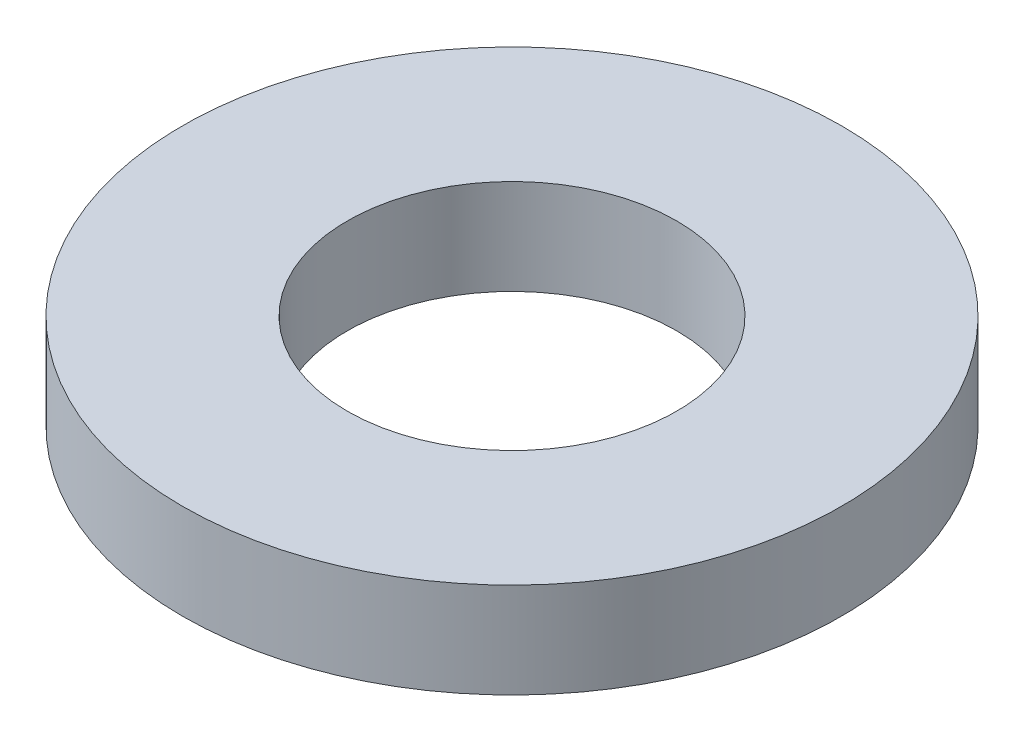
ISO-10303-21;
HEADER;
FILE_DESCRIPTION(('STEP AP214'),'2;1');
FILE_NAME('part.step','',(''),(''),'','','');
FILE_SCHEMA(('AUTOMOTIVE_DESIGN { 1 0 10303 214 1 1 1 1 }'));
ENDSEC;
DATA;
#1=APPLICATION_CONTEXT('core data for automotive mechanical design processes');
#2=APPLICATION_PROTOCOL_DEFINITION('international standard','automotive_design',2000,#1);
#3=PRODUCT_CONTEXT('',#1,'mechanical');
#4=PRODUCT('Part','Part','',(#3));
#5=PRODUCT_RELATED_PRODUCT_CATEGORY('part','',(#4));
#6=PRODUCT_DEFINITION_FORMATION('','',#4);
#7=PRODUCT_DEFINITION_CONTEXT('part definition',#1,'design');
#8=PRODUCT_DEFINITION('design','',#6,#7);
#9=PRODUCT_DEFINITION_SHAPE('','',#8);
#10=(LENGTH_UNIT() NAMED_UNIT(*) SI_UNIT(.MILLI.,.METRE.));
#11=(NAMED_UNIT(*) PLANE_ANGLE_UNIT() SI_UNIT($,.RADIAN.));
#12=(NAMED_UNIT(*) SI_UNIT($,.STERADIAN.) SOLID_ANGLE_UNIT());
#13=UNCERTAINTY_MEASURE_WITH_UNIT(LENGTH_MEASURE(1.E-05),#10,'distance_accuracy_value','');
#14=(GEOMETRIC_REPRESENTATION_CONTEXT(3) GLOBAL_UNCERTAINTY_ASSIGNED_CONTEXT((#13)) GLOBAL_UNIT_ASSIGNED_CONTEXT((#10,
#11,#12)) REPRESENTATION_CONTEXT('',''));
#15=CARTESIAN_POINT('',(0.,0.,0.));
#16=DIRECTION('',(0.,0.,1.));
#17=DIRECTION('',(1.,0.,0.));
#18=AXIS2_PLACEMENT_3D('',#15,#16,#17);
#19=CARTESIAN_POINT('',(0.,26.,0.));
#20=DIRECTION('',(0.,-1.,0.));
#21=DIRECTION('',(0.,0.,-1.));
#22=AXIS2_PLACEMENT_3D('',#19,#20,#21);
#23=CYLINDRICAL_SURFACE('',#22,90.);
#24=CARTESIAN_POINT('',(0.,26.,0.));
#25=DIRECTION('',(0.,1.,0.));
#26=DIRECTION('',(0.,0.,1.));
#27=AXIS2_PLACEMENT_3D('',#24,#25,#26);
#28=CIRCLE('',#27,90.);
#29=CARTESIAN_POINT('',(0.,26.,-90.));
#30=VERTEX_POINT('',#29);
#31=EDGE_CURVE('E10',#30,#30,#28,.T.);
#32=CARTESIAN_POINT('',(0.,0.,0.));
#33=DIRECTION('',(0.,1.,0.));
#34=DIRECTION('',(0.,0.,1.));
#35=AXIS2_PLACEMENT_3D('',#32,#33,#34);
#36=CIRCLE('',#35,90.);
#37=CARTESIAN_POINT('',(0.,0.,-90.));
#38=VERTEX_POINT('',#37);
#39=EDGE_CURVE('E37',#38,#38,#36,.T.);
#40=CARTESIAN_POINT('',(0.,26.,-90.));
#41=CARTESIAN_POINT('',(0.,25.7291666666667,-90.));
#42=CARTESIAN_POINT('',(0.,25.4583333333333,-90.));
#43=CARTESIAN_POINT('',(0.,24.9166666666667,-90.));
#44=CARTESIAN_POINT('',(0.,24.6458333333333,-90.));
#45=CARTESIAN_POINT('',(0.,24.1041666666667,-90.));
#46=CARTESIAN_POINT('',(0.,23.8333333333333,-90.));
#47=CARTESIAN_POINT('',(0.,23.2916666666667,-90.));
#48=CARTESIAN_POINT('',(0.,23.0208333333333,-90.));
#49=CARTESIAN_POINT('',(0.,22.4791666666667,-90.));
#50=CARTESIAN_POINT('',(0.,22.2083333333333,-90.));
#51=CARTESIAN_POINT('',(0.,21.6666666666667,-90.));
#52=CARTESIAN_POINT('',(0.,21.3958333333333,-90.));
#53=CARTESIAN_POINT('',(0.,20.8541666666667,-90.));
#54=CARTESIAN_POINT('',(0.,20.5833333333333,-90.));
#55=CARTESIAN_POINT('',(0.,20.0416666666667,-90.));
#56=CARTESIAN_POINT('',(0.,19.7708333333333,-90.));
#57=CARTESIAN_POINT('',(0.,19.2291666666667,-90.));
#58=CARTESIAN_POINT('',(0.,18.9583333333333,-90.));
#59=CARTESIAN_POINT('',(0.,18.4166666666667,-90.));
#60=CARTESIAN_POINT('',(0.,18.1458333333333,-90.));
#61=CARTESIAN_POINT('',(0.,17.6041666666667,-90.));
#62=CARTESIAN_POINT('',(0.,17.3333333333333,-90.));
#63=CARTESIAN_POINT('',(0.,16.7916666666667,-90.));
#64=CARTESIAN_POINT('',(0.,16.5208333333333,-90.));
#65=CARTESIAN_POINT('',(0.,15.9791666666667,-90.));
#66=CARTESIAN_POINT('',(0.,15.7083333333333,-90.));
#67=CARTESIAN_POINT('',(0.,15.1666666666667,-90.));
#68=CARTESIAN_POINT('',(0.,14.8958333333333,-90.));
#69=CARTESIAN_POINT('',(0.,14.3541666666667,-90.));
#70=CARTESIAN_POINT('',(0.,14.0833333333333,-90.));
#71=CARTESIAN_POINT('',(0.,13.5416666666667,-90.));
#72=CARTESIAN_POINT('',(0.,13.2708333333333,-90.));
#73=CARTESIAN_POINT('',(0.,12.7291666666667,-90.));
#74=CARTESIAN_POINT('',(0.,12.4583333333333,-90.));
#75=CARTESIAN_POINT('',(0.,11.9166666666667,-90.));
#76=CARTESIAN_POINT('',(0.,11.6458333333333,-90.));
#77=CARTESIAN_POINT('',(0.,11.1041666666667,-90.));
#78=CARTESIAN_POINT('',(0.,10.8333333333333,-90.));
#79=CARTESIAN_POINT('',(0.,10.2916666666667,-90.));
#80=CARTESIAN_POINT('',(0.,10.0208333333333,-90.));
#81=CARTESIAN_POINT('',(0.,9.47916666666667,-90.));
#82=CARTESIAN_POINT('',(0.,9.20833333333333,-90.));
#83=CARTESIAN_POINT('',(0.,8.66666666666667,-90.));
#84=CARTESIAN_POINT('',(0.,8.39583333333333,-90.));
#85=CARTESIAN_POINT('',(0.,7.85416666666667,-90.));
#86=CARTESIAN_POINT('',(0.,7.58333333333333,-90.));
#87=CARTESIAN_POINT('',(0.,7.04166666666667,-90.));
#88=CARTESIAN_POINT('',(0.,6.77083333333333,-90.));
#89=CARTESIAN_POINT('',(0.,6.22916666666667,-90.));
#90=CARTESIAN_POINT('',(0.,5.95833333333333,-90.));
#91=CARTESIAN_POINT('',(0.,5.41666666666667,-90.));
#92=CARTESIAN_POINT('',(0.,5.14583333333333,-90.));
#93=CARTESIAN_POINT('',(0.,4.60416666666667,-90.));
#94=CARTESIAN_POINT('',(0.,4.33333333333333,-90.));
#95=CARTESIAN_POINT('',(0.,3.79166666666667,-90.));
#96=CARTESIAN_POINT('',(0.,3.52083333333333,-90.));
#97=CARTESIAN_POINT('',(0.,2.97916666666667,-90.));
#98=CARTESIAN_POINT('',(0.,2.70833333333333,-90.));
#99=CARTESIAN_POINT('',(0.,2.16666666666667,-90.));
#100=CARTESIAN_POINT('',(0.,1.89583333333333,-90.));
#101=CARTESIAN_POINT('',(0.,1.35416666666667,-90.));
#102=CARTESIAN_POINT('',(0.,1.08333333333333,-90.));
#103=CARTESIAN_POINT('',(0.,0.541666666666667,-90.));
#104=CARTESIAN_POINT('',(0.,0.270833333333334,-90.));
#105=CARTESIAN_POINT('',(0.,0.,-90.));
#106=B_SPLINE_CURVE_WITH_KNOTS('',3,(#40,#41,#42,#43,#44,#45,#46,#47,#48,#49,#50,#51,#52,#53,
#54,#55,#56,#57,#58,#59,#60,#61,#62,#63,#64,#65,#66,#67,#68,#69,#70,#71,#72,#73,#74,#75,#76,#77,
#78,#79,#80,#81,#82,#83,#84,#85,#86,#87,#88,#89,#90,#91,#92,#93,#94,#95,#96,#97,#98,#99,#100,
#101,#102,#103,#104,#105),.UNSPECIFIED.,.F.,.F.,(4,2,2,2,2,2,2,2,2,2,2,2,2,2,2,2,2,2,2,2,2,2,2,
2,2,2,2,2,2,2,2,2,4),(0.,0.812500000000001,1.625,2.4375,3.25,4.0625,4.875,5.6875,6.5,7.3125,
8.125,8.9375,9.75,10.5625,11.375,12.1875,13.,13.8125,14.625,15.4375,16.25,17.0625,17.875,
18.6875,19.5,20.3125,21.125,21.9375,22.75,23.5625,24.375,25.1875,26.),.UNSPECIFIED.);
#107=EDGE_CURVE('BSEAM40',#30,#38,#106,.T.);
#108=ORIENTED_EDGE('',*,*,#31,.F.);
#109=ORIENTED_EDGE('',*,*,#39,.T.);
#110=ORIENTED_EDGE('',*,*,#107,.T.);
#111=ORIENTED_EDGE('',*,*,#107,.F.);
#112=EDGE_LOOP('',(#108,#110,#109,#111));
#113=FACE_BOUND('',#112,.T.);
#114=ADVANCED_FACE('F40',(#113),#23,.T.);
#115=CARTESIAN_POINT('',(0.,26.,0.));
#116=DIRECTION('',(0.,1.,0.));
#117=DIRECTION('',(0.,0.,1.));
#118=AXIS2_PLACEMENT_3D('',#115,#116,#117);
#119=PLANE('',#118);
#120=CARTESIAN_POINT('',(0.,26.,0.));
#121=DIRECTION('',(0.,1.,0.));
#122=DIRECTION('',(0.,0.,1.));
#123=AXIS2_PLACEMENT_3D('',#120,#121,#122);
#124=CIRCLE('',#123,45.);
#125=CARTESIAN_POINT('',(0.,26.,-45.));
#126=VERTEX_POINT('',#125);
#127=EDGE_CURVE('E50',#126,#126,#124,.T.);
#128=ORIENTED_EDGE('',*,*,#127,.F.);
#129=EDGE_LOOP('',(#128));
#130=FACE_BOUND('',#129,.T.);
#131=ORIENTED_EDGE('',*,*,#31,.T.);
#132=EDGE_LOOP('',(#131));
#133=FACE_BOUND('',#132,.T.);
#134=ADVANCED_FACE('F59',(#130,#133),#119,.T.);
#135=CARTESIAN_POINT('',(0.,0.,0.));
#136=DIRECTION('',(0.,1.,0.));
#137=DIRECTION('',(0.,0.,1.));
#138=AXIS2_PLACEMENT_3D('',#135,#136,#137);
#139=PLANE('',#138);
#140=CARTESIAN_POINT('',(0.,0.,0.));
#141=DIRECTION('',(0.,1.,0.));
#142=DIRECTION('',(0.,0.,1.));
#143=AXIS2_PLACEMENT_3D('',#140,#141,#142);
#144=CIRCLE('',#143,45.);
#145=CARTESIAN_POINT('',(0.,0.,-45.));
#146=VERTEX_POINT('',#145);
#147=EDGE_CURVE('E47',#146,#146,#144,.T.);
#148=ORIENTED_EDGE('',*,*,#147,.T.);
#149=EDGE_LOOP('',(#148));
#150=FACE_BOUND('',#149,.T.);
#151=ORIENTED_EDGE('',*,*,#39,.F.);
#152=EDGE_LOOP('',(#151));
#153=FACE_BOUND('',#152,.T.);
#154=ADVANCED_FACE('F58',(#150,#153),#139,.F.);
#155=CARTESIAN_POINT('',(0.,26.,0.));
#156=DIRECTION('',(0.,-1.,0.));
#157=DIRECTION('',(0.,0.,-1.));
#158=AXIS2_PLACEMENT_3D('',#155,#156,#157);
#159=CYLINDRICAL_SURFACE('',#158,45.);
#160=CARTESIAN_POINT('',(0.,26.,-45.));
#161=CARTESIAN_POINT('',(0.,25.7291666666667,-45.));
#162=CARTESIAN_POINT('',(0.,25.4583333333333,-45.));
#163=CARTESIAN_POINT('',(0.,24.9166666666667,-45.));
#164=CARTESIAN_POINT('',(0.,24.6458333333333,-45.));
#165=CARTESIAN_POINT('',(0.,24.1041666666667,-45.));
#166=CARTESIAN_POINT('',(0.,23.8333333333333,-45.));
#167=CARTESIAN_POINT('',(0.,23.2916666666667,-45.));
#168=CARTESIAN_POINT('',(0.,23.0208333333333,-45.));
#169=CARTESIAN_POINT('',(0.,22.4791666666667,-45.));
#170=CARTESIAN_POINT('',(0.,22.2083333333333,-45.));
#171=CARTESIAN_POINT('',(0.,21.6666666666667,-45.));
#172=CARTESIAN_POINT('',(0.,21.3958333333333,-45.));
#173=CARTESIAN_POINT('',(0.,20.8541666666667,-45.));
#174=CARTESIAN_POINT('',(0.,20.5833333333333,-45.));
#175=CARTESIAN_POINT('',(0.,20.0416666666667,-45.));
#176=CARTESIAN_POINT('',(0.,19.7708333333333,-45.));
#177=CARTESIAN_POINT('',(0.,19.2291666666667,-45.));
#178=CARTESIAN_POINT('',(0.,18.9583333333333,-45.));
#179=CARTESIAN_POINT('',(0.,18.4166666666667,-45.));
#180=CARTESIAN_POINT('',(0.,18.1458333333333,-45.));
#181=CARTESIAN_POINT('',(0.,17.6041666666667,-45.));
#182=CARTESIAN_POINT('',(0.,17.3333333333333,-45.));
#183=CARTESIAN_POINT('',(0.,16.7916666666667,-45.));
#184=CARTESIAN_POINT('',(0.,16.5208333333333,-45.));
#185=CARTESIAN_POINT('',(0.,15.9791666666667,-45.));
#186=CARTESIAN_POINT('',(0.,15.7083333333333,-45.));
#187=CARTESIAN_POINT('',(0.,15.1666666666667,-45.));
#188=CARTESIAN_POINT('',(0.,14.8958333333333,-45.));
#189=CARTESIAN_POINT('',(0.,14.3541666666667,-45.));
#190=CARTESIAN_POINT('',(0.,14.0833333333333,-45.));
#191=CARTESIAN_POINT('',(0.,13.5416666666667,-45.));
#192=CARTESIAN_POINT('',(0.,13.2708333333333,-45.));
#193=CARTESIAN_POINT('',(0.,12.7291666666667,-45.));
#194=CARTESIAN_POINT('',(0.,12.4583333333333,-45.));
#195=CARTESIAN_POINT('',(0.,11.9166666666667,-45.));
#196=CARTESIAN_POINT('',(0.,11.6458333333333,-45.));
#197=CARTESIAN_POINT('',(0.,11.1041666666667,-45.));
#198=CARTESIAN_POINT('',(0.,10.8333333333333,-45.));
#199=CARTESIAN_POINT('',(0.,10.2916666666667,-45.));
#200=CARTESIAN_POINT('',(0.,10.0208333333333,-45.));
#201=CARTESIAN_POINT('',(0.,9.47916666666667,-45.));
#202=CARTESIAN_POINT('',(0.,9.20833333333333,-45.));
#203=CARTESIAN_POINT('',(0.,8.66666666666667,-45.));
#204=CARTESIAN_POINT('',(0.,8.39583333333333,-45.));
#205=CARTESIAN_POINT('',(0.,7.85416666666667,-45.));
#206=CARTESIAN_POINT('',(0.,7.58333333333333,-45.));
#207=CARTESIAN_POINT('',(0.,7.04166666666667,-45.));
#208=CARTESIAN_POINT('',(0.,6.77083333333333,-45.));
#209=CARTESIAN_POINT('',(0.,6.22916666666667,-45.));
#210=CARTESIAN_POINT('',(0.,5.95833333333333,-45.));
#211=CARTESIAN_POINT('',(0.,5.41666666666667,-45.));
#212=CARTESIAN_POINT('',(0.,5.14583333333333,-45.));
#213=CARTESIAN_POINT('',(0.,4.60416666666667,-45.));
#214=CARTESIAN_POINT('',(0.,4.33333333333333,-45.));
#215=CARTESIAN_POINT('',(0.,3.79166666666667,-45.));
#216=CARTESIAN_POINT('',(0.,3.52083333333333,-45.));
#217=CARTESIAN_POINT('',(0.,2.97916666666667,-45.));
#218=CARTESIAN_POINT('',(0.,2.70833333333333,-45.));
#219=CARTESIAN_POINT('',(0.,2.16666666666667,-45.));
#220=CARTESIAN_POINT('',(0.,1.89583333333333,-45.));
#221=CARTESIAN_POINT('',(0.,1.35416666666667,-45.));
#222=CARTESIAN_POINT('',(0.,1.08333333333333,-45.));
#223=CARTESIAN_POINT('',(0.,0.541666666666667,-45.));
#224=CARTESIAN_POINT('',(0.,0.270833333333334,-45.));
#225=CARTESIAN_POINT('',(0.,0.,-45.));
#226=B_SPLINE_CURVE_WITH_KNOTS('',3,(#160,#161,#162,#163,#164,#165,#166,#167,#168,#169,#170,
#171,#172,#173,#174,#175,#176,#177,#178,#179,#180,#181,#182,#183,#184,#185,#186,#187,#188,#189,
#190,#191,#192,#193,#194,#195,#196,#197,#198,#199,#200,#201,#202,#203,#204,#205,#206,#207,#208,
#209,#210,#211,#212,#213,#214,#215,#216,#217,#218,#219,#220,#221,#222,#223,#224,#225),
.UNSPECIFIED.,.F.,.F.,(4,2,2,2,2,2,2,2,2,2,2,2,2,2,2,2,2,2,2,2,2,2,2,2,2,2,2,2,2,2,2,2,4),(0.,
0.812499999999997,1.625,2.4375,3.25,4.0625,4.875,5.6875,6.5,7.3125,8.125,8.93749999999999,
9.74999999999999,10.5625,11.375,12.1875,13.,13.8125,14.625,15.4375,16.25,17.0625,17.875,18.6875,
19.5,20.3125,21.125,21.9375,22.75,23.5625,24.375,25.1875,26.),.UNSPECIFIED.);
#227=EDGE_CURVE('BSEAM54',#126,#146,#226,.T.);
#228=ORIENTED_EDGE('',*,*,#127,.T.);
#229=ORIENTED_EDGE('',*,*,#147,.F.);
#230=ORIENTED_EDGE('',*,*,#227,.T.);
#231=ORIENTED_EDGE('',*,*,#227,.F.);
#232=EDGE_LOOP('',(#228,#230,#229,#231));
#233=FACE_BOUND('',#232,.T.);
#234=ADVANCED_FACE('F54',(#233),#159,.F.);
#235=CLOSED_SHELL('',(#114,#134,#154,#234));
#236=MANIFOLD_SOLID_BREP('B2',#235);
#237=ADVANCED_BREP_SHAPE_REPRESENTATION('',(#18,#236),#14);
#238=SHAPE_DEFINITION_REPRESENTATION(#9,#237);
ENDSEC;
END-ISO-10303-21;
